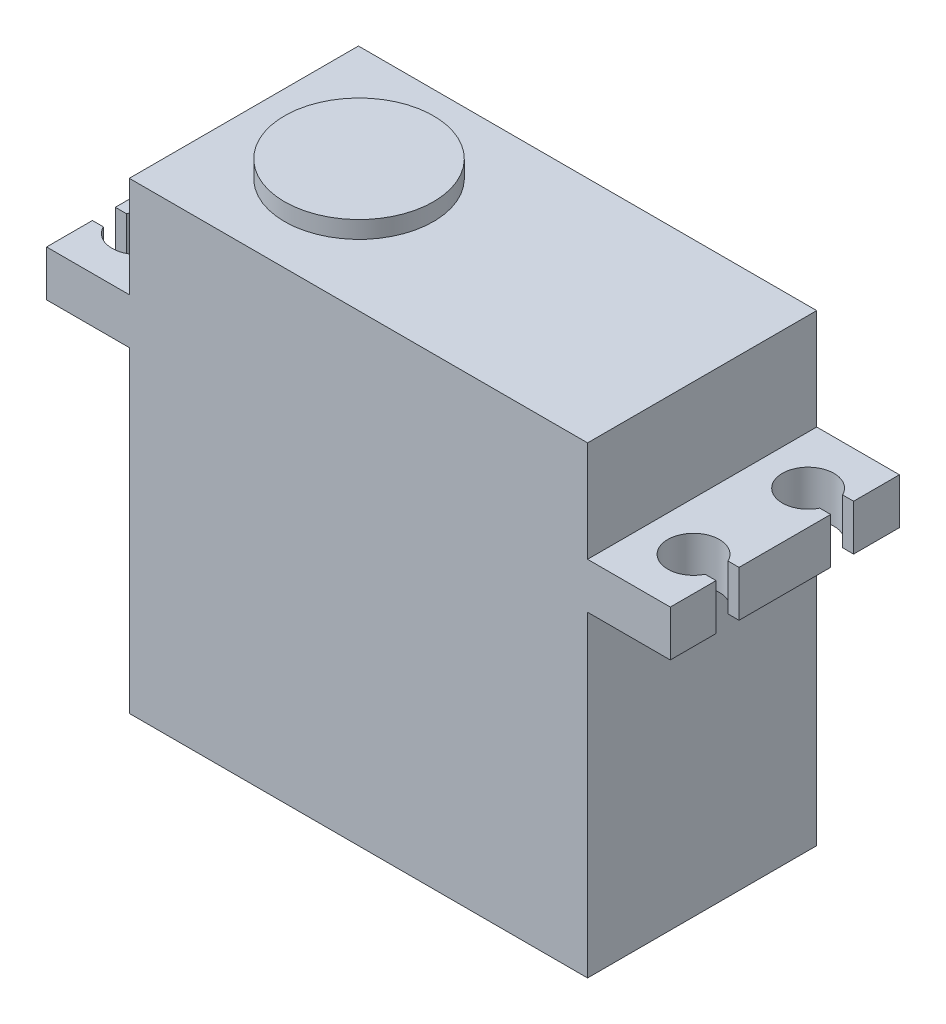
ISO-10303-21;
HEADER;
FILE_DESCRIPTION(('STEP AP214'),'2;1');
FILE_NAME('part.step','',(''),(''),'','','');
FILE_SCHEMA(('AUTOMOTIVE_DESIGN { 1 0 10303 214 1 1 1 1 }'));
ENDSEC;
DATA;
#1=APPLICATION_CONTEXT('core data for automotive mechanical design processes');
#2=APPLICATION_PROTOCOL_DEFINITION('international standard','automotive_design',2000,#1);
#3=PRODUCT_CONTEXT('',#1,'mechanical');
#4=PRODUCT('Part','Part','',(#3));
#5=PRODUCT_RELATED_PRODUCT_CATEGORY('part','',(#4));
#6=PRODUCT_DEFINITION_FORMATION('','',#4);
#7=PRODUCT_DEFINITION_CONTEXT('part definition',#1,'design');
#8=PRODUCT_DEFINITION('design','',#6,#7);
#9=PRODUCT_DEFINITION_SHAPE('','',#8);
#10=(LENGTH_UNIT() NAMED_UNIT(*) SI_UNIT(.MILLI.,.METRE.));
#11=(NAMED_UNIT(*) PLANE_ANGLE_UNIT() SI_UNIT($,.RADIAN.));
#12=(NAMED_UNIT(*) SI_UNIT($,.STERADIAN.) SOLID_ANGLE_UNIT());
#13=UNCERTAINTY_MEASURE_WITH_UNIT(LENGTH_MEASURE(1.E-05),#10,'distance_accuracy_value','');
#14=(GEOMETRIC_REPRESENTATION_CONTEXT(3) GLOBAL_UNCERTAINTY_ASSIGNED_CONTEXT((#13)) GLOBAL_UNIT_ASSIGNED_CONTEXT((#10,
#11,#12)) REPRESENTATION_CONTEXT('',''));
#15=CARTESIAN_POINT('',(0.,0.,0.));
#16=DIRECTION('',(0.,0.,1.));
#17=DIRECTION('',(1.,0.,0.));
#18=AXIS2_PLACEMENT_3D('',#15,#16,#17);
#19=CARTESIAN_POINT('',(27.22,0.,0.));
#20=DIRECTION('',(1.,0.,0.));
#21=DIRECTION('',(0.,0.,1.));
#22=AXIS2_PLACEMENT_3D('',#19,#20,#21);
#23=PLANE('',#22);
#24=DIRECTION('',(0.,1.,0.));
#25=VECTOR('',#24,1.);
#26=CARTESIAN_POINT('',(27.22,27.65,4.));
#27=LINE('',#26,#25);
#28=CARTESIAN_POINT('',(27.22,27.65,4.));
#29=VERTEX_POINT('',#28);
#30=CARTESIAN_POINT('',(27.22,31.65,4.));
#31=VERTEX_POINT('',#30);
#32=EDGE_CURVE('E285',#29,#31,#27,.T.);
#33=ORIENTED_EDGE('',*,*,#32,.F.);
#34=DIRECTION('',(0.,0.,1.));
#35=VECTOR('',#34,1.);
#36=CARTESIAN_POINT('',(27.22,27.65,-10.));
#37=LINE('',#36,#35);
#38=CARTESIAN_POINT('',(27.22,27.65,-4.));
#39=VERTEX_POINT('',#38);
#40=EDGE_CURVE('E328',#39,#29,#37,.T.);
#41=ORIENTED_EDGE('',*,*,#40,.F.);
#42=DIRECTION('',(0.,1.,0.));
#43=VECTOR('',#42,1.);
#44=CARTESIAN_POINT('',(27.22,27.65,-4.));
#45=LINE('',#44,#43);
#46=CARTESIAN_POINT('',(27.22,31.65,-4.));
#47=VERTEX_POINT('',#46);
#48=EDGE_CURVE('E308',#39,#47,#45,.T.);
#49=ORIENTED_EDGE('',*,*,#48,.T.);
#50=DIRECTION('',(0.,0.,-1.));
#51=VECTOR('',#50,1.);
#52=CARTESIAN_POINT('',(27.22,31.65,10.));
#53=LINE('',#52,#51);
#54=EDGE_CURVE('E63',#31,#47,#53,.T.);
#55=ORIENTED_EDGE('',*,*,#54,.F.);
#56=EDGE_LOOP('',(#33,#41,#49,#55));
#57=FACE_BOUND('',#56,.T.);
#58=ADVANCED_FACE('F40',(#57),#23,.T.);
#59=CARTESIAN_POINT('',(27.22,31.65,10.));
#60=DIRECTION('',(0.,1.,0.));
#61=DIRECTION('',(0.,0.,1.));
#62=AXIS2_PLACEMENT_3D('',#59,#60,#61);
#63=PLANE('',#62);
#64=DIRECTION('',(-1.,0.,0.));
#65=VECTOR('',#64,1.);
#66=CARTESIAN_POINT('',(27.22,31.65,4.));
#67=LINE('',#66,#65);
#68=CARTESIAN_POINT('',(26.2655644370746,31.65,4.));
#69=VERTEX_POINT('',#68);
#70=EDGE_CURVE('E270',#31,#69,#67,.T.);
#71=ORIENTED_EDGE('',*,*,#70,.F.);
#72=ORIENTED_EDGE('',*,*,#54,.T.);
#73=DIRECTION('',(-1.,0.,0.));
#74=VECTOR('',#73,1.);
#75=CARTESIAN_POINT('',(27.22,31.65,-4.));
#76=LINE('',#75,#74);
#77=CARTESIAN_POINT('',(26.2655644370746,31.65,-4.));
#78=VERTEX_POINT('',#77);
#79=EDGE_CURVE('E298',#47,#78,#76,.T.);
#80=ORIENTED_EDGE('',*,*,#79,.T.);
#81=CARTESIAN_POINT('',(24.25,31.65,-5.));
#82=DIRECTION('',(0.,-1.,0.));
#83=DIRECTION('',(0.,0.,1.));
#84=AXIS2_PLACEMENT_3D('',#81,#82,#83);
#85=CIRCLE('',#84,2.25);
#86=CARTESIAN_POINT('',(26.2655644370746,31.65,-6.));
#87=VERTEX_POINT('',#86);
#88=EDGE_CURVE('E284',#78,#87,#85,.T.);
#89=ORIENTED_EDGE('',*,*,#88,.T.);
#90=DIRECTION('',(1.,0.,0.));
#91=VECTOR('',#90,1.);
#92=CARTESIAN_POINT('',(26.2655644370746,31.65,-6.));
#93=LINE('',#92,#91);
#94=CARTESIAN_POINT('',(27.22,31.65,-6.));
#95=VERTEX_POINT('',#94);
#96=EDGE_CURVE('E291',#87,#95,#93,.T.);
#97=ORIENTED_EDGE('',*,*,#96,.T.);
#98=CARTESIAN_POINT('',(27.22,31.65,-10.));
#99=VERTEX_POINT('',#98);
#100=EDGE_CURVE('E315',#95,#99,#53,.T.);
#101=ORIENTED_EDGE('',*,*,#100,.T.);
#102=DIRECTION('',(-1.,0.,0.));
#103=VECTOR('',#102,1.);
#104=CARTESIAN_POINT('',(27.22,31.65,-10.));
#105=LINE('',#104,#103);
#106=CARTESIAN_POINT('',(20.,31.65,-10.));
#107=VERTEX_POINT('',#106);
#108=EDGE_CURVE('E338',#99,#107,#105,.T.);
#109=ORIENTED_EDGE('',*,*,#108,.T.);
#110=DIRECTION('',(0.,0.,-1.));
#111=VECTOR('',#110,1.);
#112=CARTESIAN_POINT('',(20.,31.65,10.));
#113=LINE('',#112,#111);
#114=CARTESIAN_POINT('',(20.,31.65,10.));
#115=VERTEX_POINT('',#114);
#116=EDGE_CURVE('E305',#115,#107,#113,.T.);
#117=ORIENTED_EDGE('',*,*,#116,.F.);
#118=DIRECTION('',(-1.,0.,0.));
#119=VECTOR('',#118,1.);
#120=CARTESIAN_POINT('',(27.22,31.65,10.));
#121=LINE('',#120,#119);
#122=CARTESIAN_POINT('',(27.22,31.65,10.));
#123=VERTEX_POINT('',#122);
#124=EDGE_CURVE('E336',#123,#115,#121,.T.);
#125=ORIENTED_EDGE('',*,*,#124,.F.);
#126=CARTESIAN_POINT('',(27.22,31.65,6.));
#127=VERTEX_POINT('',#126);
#128=EDGE_CURVE('E317',#123,#127,#53,.T.);
#129=ORIENTED_EDGE('',*,*,#128,.T.);
#130=DIRECTION('',(1.,0.,0.));
#131=VECTOR('',#130,1.);
#132=CARTESIAN_POINT('',(26.2655644370746,31.65,6.));
#133=LINE('',#132,#131);
#134=CARTESIAN_POINT('',(26.2655644370746,31.65,6.));
#135=VERTEX_POINT('',#134);
#136=EDGE_CURVE('E55',#135,#127,#133,.T.);
#137=ORIENTED_EDGE('',*,*,#136,.F.);
#138=CARTESIAN_POINT('',(24.25,31.65,5.));
#139=DIRECTION('',(0.,1.,0.));
#140=DIRECTION('',(0.,0.,-1.));
#141=AXIS2_PLACEMENT_3D('',#138,#139,#140);
#142=CIRCLE('',#141,2.25);
#143=EDGE_CURVE('E258',#69,#135,#142,.T.);
#144=ORIENTED_EDGE('',*,*,#143,.F.);
#145=EDGE_LOOP('',(#71,#72,#80,#89,#97,#101,#109,#117,#125,#129,#137,#144));
#146=FACE_BOUND('',#145,.T.);
#147=ADVANCED_FACE('F537',(#146),#63,.T.);
#148=CARTESIAN_POINT('',(27.22,27.65,-10.));
#149=DIRECTION('',(0.,-1.,0.));
#150=DIRECTION('',(0.,0.,-1.));
#151=AXIS2_PLACEMENT_3D('',#148,#149,#150);
#152=PLANE('',#151);
#153=DIRECTION('',(-1.,0.,0.));
#154=VECTOR('',#153,1.);
#155=CARTESIAN_POINT('',(27.22,27.65,4.));
#156=LINE('',#155,#154);
#157=CARTESIAN_POINT('',(26.2655644370746,27.65,4.));
#158=VERTEX_POINT('',#157);
#159=EDGE_CURVE('E260',#29,#158,#156,.T.);
#160=ORIENTED_EDGE('',*,*,#159,.T.);
#161=CARTESIAN_POINT('',(24.25,27.65,5.));
#162=DIRECTION('',(0.,1.,0.));
#163=DIRECTION('',(0.,0.,-1.));
#164=AXIS2_PLACEMENT_3D('',#161,#162,#163);
#165=CIRCLE('',#164,2.25);
#166=CARTESIAN_POINT('',(26.2655644370746,27.65,6.));
#167=VERTEX_POINT('',#166);
#168=EDGE_CURVE('E255',#158,#167,#165,.T.);
#169=ORIENTED_EDGE('',*,*,#168,.T.);
#170=DIRECTION('',(1.,0.,0.));
#171=VECTOR('',#170,1.);
#172=CARTESIAN_POINT('',(26.2655644370746,27.65,6.));
#173=LINE('',#172,#171);
#174=CARTESIAN_POINT('',(27.22,27.65,6.));
#175=VERTEX_POINT('',#174);
#176=EDGE_CURVE('E263',#167,#175,#173,.T.);
#177=ORIENTED_EDGE('',*,*,#176,.T.);
#178=CARTESIAN_POINT('',(27.22,27.65,10.));
#179=VERTEX_POINT('',#178);
#180=EDGE_CURVE('E323',#175,#179,#37,.T.);
#181=ORIENTED_EDGE('',*,*,#180,.T.);
#182=DIRECTION('',(-1.,0.,0.));
#183=VECTOR('',#182,1.);
#184=CARTESIAN_POINT('',(27.22,27.65,10.));
#185=LINE('',#184,#183);
#186=CARTESIAN_POINT('',(20.,27.65,10.));
#187=VERTEX_POINT('',#186);
#188=EDGE_CURVE('E334',#179,#187,#185,.T.);
#189=ORIENTED_EDGE('',*,*,#188,.T.);
#190=DIRECTION('',(0.,0.,1.));
#191=VECTOR('',#190,1.);
#192=CARTESIAN_POINT('',(20.,27.65,-10.));
#193=LINE('',#192,#191);
#194=CARTESIAN_POINT('',(20.,27.65,-10.));
#195=VERTEX_POINT('',#194);
#196=EDGE_CURVE('E316',#195,#187,#193,.T.);
#197=ORIENTED_EDGE('',*,*,#196,.F.);
#198=DIRECTION('',(-1.,0.,0.));
#199=VECTOR('',#198,1.);
#200=CARTESIAN_POINT('',(27.22,27.65,-10.));
#201=LINE('',#200,#199);
#202=CARTESIAN_POINT('',(27.22,27.65,-10.));
#203=VERTEX_POINT('',#202);
#204=EDGE_CURVE('E327',#203,#195,#201,.T.);
#205=ORIENTED_EDGE('',*,*,#204,.F.);
#206=CARTESIAN_POINT('',(27.22,27.65,-6.));
#207=VERTEX_POINT('',#206);
#208=EDGE_CURVE('E324',#203,#207,#37,.T.);
#209=ORIENTED_EDGE('',*,*,#208,.T.);
#210=DIRECTION('',(1.,0.,0.));
#211=VECTOR('',#210,1.);
#212=CARTESIAN_POINT('',(26.2655644370746,27.65,-6.));
#213=LINE('',#212,#211);
#214=CARTESIAN_POINT('',(26.2655644370746,27.65,-6.));
#215=VERTEX_POINT('',#214);
#216=EDGE_CURVE('E293',#215,#207,#213,.T.);
#217=ORIENTED_EDGE('',*,*,#216,.F.);
#218=CARTESIAN_POINT('',(24.25,27.65,-5.));
#219=DIRECTION('',(0.,-1.,0.));
#220=DIRECTION('',(0.,0.,1.));
#221=AXIS2_PLACEMENT_3D('',#218,#219,#220);
#222=CIRCLE('',#221,2.25);
#223=CARTESIAN_POINT('',(26.2655644370746,27.65,-4.));
#224=VERTEX_POINT('',#223);
#225=EDGE_CURVE('E288',#224,#215,#222,.T.);
#226=ORIENTED_EDGE('',*,*,#225,.F.);
#227=DIRECTION('',(-1.,0.,0.));
#228=VECTOR('',#227,1.);
#229=CARTESIAN_POINT('',(27.22,27.65,-4.));
#230=LINE('',#229,#228);
#231=EDGE_CURVE('E290',#39,#224,#230,.T.);
#232=ORIENTED_EDGE('',*,*,#231,.F.);
#233=ORIENTED_EDGE('',*,*,#40,.T.);
#234=EDGE_LOOP('',(#160,#169,#177,#181,#189,#197,#205,#209,#217,#226,#232,#233));
#235=FACE_BOUND('',#234,.T.);
#236=ADVANCED_FACE('F268',(#235),#152,.T.);
#237=ORIENTED_EDGE('',*,*,#100,.F.);
#238=DIRECTION('',(0.,1.,0.));
#239=VECTOR('',#238,1.);
#240=CARTESIAN_POINT('',(27.22,27.65,-6.));
#241=LINE('',#240,#239);
#242=EDGE_CURVE('E306',#207,#95,#241,.T.);
#243=ORIENTED_EDGE('',*,*,#242,.F.);
#244=ORIENTED_EDGE('',*,*,#208,.F.);
#245=DIRECTION('',(0.,-1.,0.));
#246=VECTOR('',#245,1.);
#247=CARTESIAN_POINT('',(27.22,31.65,-10.));
#248=LINE('',#247,#246);
#249=EDGE_CURVE('E312',#99,#203,#248,.T.);
#250=ORIENTED_EDGE('',*,*,#249,.F.);
#251=EDGE_LOOP('',(#237,#243,#244,#250));
#252=FACE_BOUND('',#251,.T.);
#253=ADVANCED_FACE('F542',(#252),#23,.T.);
#254=DIRECTION('',(0.,1.,0.));
#255=VECTOR('',#254,1.);
#256=CARTESIAN_POINT('',(27.22,27.65,6.));
#257=LINE('',#256,#255);
#258=EDGE_CURVE('E259',#175,#127,#257,.T.);
#259=ORIENTED_EDGE('',*,*,#258,.T.);
#260=ORIENTED_EDGE('',*,*,#128,.F.);
#261=DIRECTION('',(0.,1.,0.));
#262=VECTOR('',#261,1.);
#263=CARTESIAN_POINT('',(27.22,27.65,10.));
#264=LINE('',#263,#262);
#265=EDGE_CURVE('E320',#179,#123,#264,.T.);
#266=ORIENTED_EDGE('',*,*,#265,.F.);
#267=ORIENTED_EDGE('',*,*,#180,.F.);
#268=EDGE_LOOP('',(#259,#260,#266,#267));
#269=FACE_BOUND('',#268,.T.);
#270=ADVANCED_FACE('F549',(#269),#23,.T.);
#271=CARTESIAN_POINT('',(20.,27.65,10.));
#272=DIRECTION('',(-1.,0.,0.));
#273=DIRECTION('',(0.,0.,1.));
#274=AXIS2_PLACEMENT_3D('',#271,#272,#273);
#275=PLANE('',#274);
#276=DIRECTION('',(0.,-1.,0.));
#277=VECTOR('',#276,1.);
#278=CARTESIAN_POINT('',(20.,27.65,-10.));
#279=LINE('',#278,#277);
#280=CARTESIAN_POINT('',(20.,0.,-10.));
#281=VERTEX_POINT('',#280);
#282=EDGE_CURVE('E48',#195,#281,#279,.T.);
#283=ORIENTED_EDGE('',*,*,#282,.F.);
#284=ORIENTED_EDGE('',*,*,#196,.T.);
#285=DIRECTION('',(0.,-1.,0.));
#286=VECTOR('',#285,1.);
#287=CARTESIAN_POINT('',(20.,27.65,10.));
#288=LINE('',#287,#286);
#289=CARTESIAN_POINT('',(20.,0.,10.));
#290=VERTEX_POINT('',#289);
#291=EDGE_CURVE('E479',#187,#290,#288,.T.);
#292=ORIENTED_EDGE('',*,*,#291,.T.);
#293=DIRECTION('',(0.,0.,-1.));
#294=VECTOR('',#293,1.);
#295=CARTESIAN_POINT('',(20.,0.,10.));
#296=LINE('',#295,#294);
#297=EDGE_CURVE('E467',#290,#281,#296,.T.);
#298=ORIENTED_EDGE('',*,*,#297,.T.);
#299=EDGE_LOOP('',(#283,#284,#292,#298));
#300=FACE_BOUND('',#299,.T.);
#301=ADVANCED_FACE('F546',(#300),#275,.F.);
#302=CARTESIAN_POINT('',(-27.22,0.,0.));
#303=DIRECTION('',(-1.,0.,0.));
#304=DIRECTION('',(0.,0.,1.));
#305=AXIS2_PLACEMENT_3D('',#302,#303,#304);
#306=PLANE('',#305);
#307=DIRECTION('',(0.,0.,-1.));
#308=VECTOR('',#307,1.);
#309=CARTESIAN_POINT('',(-27.22,31.65,10.));
#310=LINE('',#309,#308);
#311=CARTESIAN_POINT('',(-27.22,31.65,10.));
#312=VERTEX_POINT('',#311);
#313=CARTESIAN_POINT('',(-27.22,31.65,6.));
#314=VERTEX_POINT('',#313);
#315=EDGE_CURVE('E406',#312,#314,#310,.T.);
#316=ORIENTED_EDGE('',*,*,#315,.T.);
#317=DIRECTION('',(0.,1.,0.));
#318=VECTOR('',#317,1.);
#319=CARTESIAN_POINT('',(-27.22,27.65,6.));
#320=LINE('',#319,#318);
#321=CARTESIAN_POINT('',(-27.22,27.65,6.));
#322=VERTEX_POINT('',#321);
#323=EDGE_CURVE('E360',#322,#314,#320,.T.);
#324=ORIENTED_EDGE('',*,*,#323,.F.);
#325=DIRECTION('',(0.,0.,1.));
#326=VECTOR('',#325,1.);
#327=CARTESIAN_POINT('',(-27.22,27.65,-10.));
#328=LINE('',#327,#326);
#329=CARTESIAN_POINT('',(-27.22,27.65,10.));
#330=VERTEX_POINT('',#329);
#331=EDGE_CURVE('E397',#322,#330,#328,.T.);
#332=ORIENTED_EDGE('',*,*,#331,.T.);
#333=DIRECTION('',(0.,1.,0.));
#334=VECTOR('',#333,1.);
#335=CARTESIAN_POINT('',(-27.22,27.65,10.));
#336=LINE('',#335,#334);
#337=EDGE_CURVE('E402',#330,#312,#336,.T.);
#338=ORIENTED_EDGE('',*,*,#337,.T.);
#339=EDGE_LOOP('',(#316,#324,#332,#338));
#340=FACE_BOUND('',#339,.T.);
#341=ADVANCED_FACE('F548',(#340),#306,.T.);
#342=CARTESIAN_POINT('',(-27.22,27.65,-4.));
#343=VERTEX_POINT('',#342);
#344=CARTESIAN_POINT('',(-27.22,27.65,4.));
#345=VERTEX_POINT('',#344);
#346=EDGE_CURVE('E403',#343,#345,#328,.T.);
#347=ORIENTED_EDGE('',*,*,#346,.T.);
#348=DIRECTION('',(0.,1.,0.));
#349=VECTOR('',#348,1.);
#350=CARTESIAN_POINT('',(-27.22,27.65,4.));
#351=LINE('',#350,#349);
#352=CARTESIAN_POINT('',(-27.22,31.65,4.));
#353=VERTEX_POINT('',#352);
#354=EDGE_CURVE('E362',#345,#353,#351,.T.);
#355=ORIENTED_EDGE('',*,*,#354,.T.);
#356=CARTESIAN_POINT('',(-27.22,31.65,-4.));
#357=VERTEX_POINT('',#356);
#358=EDGE_CURVE('E410',#353,#357,#310,.T.);
#359=ORIENTED_EDGE('',*,*,#358,.T.);
#360=DIRECTION('',(0.,1.,0.));
#361=VECTOR('',#360,1.);
#362=CARTESIAN_POINT('',(-27.22,27.65,-4.));
#363=LINE('',#362,#361);
#364=EDGE_CURVE('E387',#343,#357,#363,.T.);
#365=ORIENTED_EDGE('',*,*,#364,.F.);
#366=EDGE_LOOP('',(#347,#355,#359,#365));
#367=FACE_BOUND('',#366,.T.);
#368=ADVANCED_FACE('F554',(#367),#306,.T.);
#369=CARTESIAN_POINT('',(-27.22,27.65,-10.));
#370=DIRECTION('',(0.,1.,0.));
#371=DIRECTION('',(0.,0.,1.));
#372=AXIS2_PLACEMENT_3D('',#369,#370,#371);
#373=PLANE('',#372);
#374=DIRECTION('',(-1.,0.,0.));
#375=VECTOR('',#374,1.);
#376=CARTESIAN_POINT('',(-26.2655644370746,27.65,6.));
#377=LINE('',#376,#375);
#378=CARTESIAN_POINT('',(-26.2655644370746,27.65,6.));
#379=VERTEX_POINT('',#378);
#380=EDGE_CURVE('E346',#379,#322,#377,.T.);
#381=ORIENTED_EDGE('',*,*,#380,.F.);
#382=CARTESIAN_POINT('',(-24.25,27.65,5.));
#383=DIRECTION('',(0.,-1.,0.));
#384=DIRECTION('',(0.,0.,-1.));
#385=AXIS2_PLACEMENT_3D('',#382,#383,#384);
#386=CIRCLE('',#385,2.25);
#387=CARTESIAN_POINT('',(-26.2655644370746,27.65,4.));
#388=VERTEX_POINT('',#387);
#389=EDGE_CURVE('E341',#388,#379,#386,.T.);
#390=ORIENTED_EDGE('',*,*,#389,.F.);
#391=DIRECTION('',(1.,0.,0.));
#392=VECTOR('',#391,1.);
#393=CARTESIAN_POINT('',(-27.22,27.65,4.));
#394=LINE('',#393,#392);
#395=EDGE_CURVE('E343',#345,#388,#394,.T.);
#396=ORIENTED_EDGE('',*,*,#395,.F.);
#397=ORIENTED_EDGE('',*,*,#346,.F.);
#398=DIRECTION('',(1.,0.,0.));
#399=VECTOR('',#398,1.);
#400=CARTESIAN_POINT('',(-27.22,27.65,-4.));
#401=LINE('',#400,#399);
#402=CARTESIAN_POINT('',(-26.2655644370746,27.65,-4.));
#403=VERTEX_POINT('',#402);
#404=EDGE_CURVE('E374',#343,#403,#401,.T.);
#405=ORIENTED_EDGE('',*,*,#404,.T.);
#406=CARTESIAN_POINT('',(-24.25,27.65,-5.));
#407=DIRECTION('',(0.,1.,0.));
#408=DIRECTION('',(0.,0.,1.));
#409=AXIS2_PLACEMENT_3D('',#406,#407,#408);
#410=CIRCLE('',#409,2.25);
#411=CARTESIAN_POINT('',(-26.2655644370746,27.65,-6.));
#412=VERTEX_POINT('',#411);
#413=EDGE_CURVE('E367',#403,#412,#410,.T.);
#414=ORIENTED_EDGE('',*,*,#413,.T.);
#415=DIRECTION('',(-1.,0.,0.));
#416=VECTOR('',#415,1.);
#417=CARTESIAN_POINT('',(-26.2655644370746,27.65,-6.));
#418=LINE('',#417,#416);
#419=CARTESIAN_POINT('',(-27.22,27.65,-6.));
#420=VERTEX_POINT('',#419);
#421=EDGE_CURVE('E370',#412,#420,#418,.T.);
#422=ORIENTED_EDGE('',*,*,#421,.T.);
#423=CARTESIAN_POINT('',(-27.22,27.65,-10.));
#424=VERTEX_POINT('',#423);
#425=EDGE_CURVE('E399',#424,#420,#328,.T.);
#426=ORIENTED_EDGE('',*,*,#425,.F.);
#427=DIRECTION('',(1.,0.,0.));
#428=VECTOR('',#427,1.);
#429=CARTESIAN_POINT('',(-27.22,27.65,-10.));
#430=LINE('',#429,#428);
#431=CARTESIAN_POINT('',(-20.,27.65,-10.));
#432=VERTEX_POINT('',#431);
#433=EDGE_CURVE('E420',#424,#432,#430,.T.);
#434=ORIENTED_EDGE('',*,*,#433,.T.);
#435=DIRECTION('',(0.,0.,1.));
#436=VECTOR('',#435,1.);
#437=CARTESIAN_POINT('',(-20.,27.65,-10.));
#438=LINE('',#437,#436);
#439=CARTESIAN_POINT('',(-20.,27.65,10.));
#440=VERTEX_POINT('',#439);
#441=EDGE_CURVE('E386',#432,#440,#438,.T.);
#442=ORIENTED_EDGE('',*,*,#441,.T.);
#443=DIRECTION('',(1.,0.,0.));
#444=VECTOR('',#443,1.);
#445=CARTESIAN_POINT('',(-27.22,27.65,10.));
#446=LINE('',#445,#444);
#447=EDGE_CURVE('E418',#330,#440,#446,.T.);
#448=ORIENTED_EDGE('',*,*,#447,.F.);
#449=ORIENTED_EDGE('',*,*,#331,.F.);
#450=EDGE_LOOP('',(#381,#390,#396,#397,#405,#414,#422,#426,#434,#442,#448,#449));
#451=FACE_BOUND('',#450,.T.);
#452=ADVANCED_FACE('F517',(#451),#373,.F.);
#453=CARTESIAN_POINT('',(-27.22,31.65,10.));
#454=DIRECTION('',(0.,-1.,0.));
#455=DIRECTION('',(0.,0.,-1.));
#456=AXIS2_PLACEMENT_3D('',#453,#454,#455);
#457=PLANE('',#456);
#458=DIRECTION('',(-1.,0.,0.));
#459=VECTOR('',#458,1.);
#460=CARTESIAN_POINT('',(-26.2655644370746,31.65,6.));
#461=LINE('',#460,#459);
#462=CARTESIAN_POINT('',(-26.2655644370746,31.65,6.));
#463=VERTEX_POINT('',#462);
#464=EDGE_CURVE('E344',#463,#314,#461,.T.);
#465=ORIENTED_EDGE('',*,*,#464,.T.);
#466=ORIENTED_EDGE('',*,*,#315,.F.);
#467=DIRECTION('',(1.,0.,0.));
#468=VECTOR('',#467,1.);
#469=CARTESIAN_POINT('',(-27.22,31.65,10.));
#470=LINE('',#469,#468);
#471=CARTESIAN_POINT('',(-20.,31.65,10.));
#472=VERTEX_POINT('',#471);
#473=EDGE_CURVE('E416',#312,#472,#470,.T.);
#474=ORIENTED_EDGE('',*,*,#473,.T.);
#475=DIRECTION('',(0.,0.,-1.));
#476=VECTOR('',#475,1.);
#477=CARTESIAN_POINT('',(-20.,31.65,10.));
#478=LINE('',#477,#476);
#479=CARTESIAN_POINT('',(-20.,31.65,-10.));
#480=VERTEX_POINT('',#479);
#481=EDGE_CURVE('E398',#472,#480,#478,.T.);
#482=ORIENTED_EDGE('',*,*,#481,.T.);
#483=DIRECTION('',(1.,0.,0.));
#484=VECTOR('',#483,1.);
#485=CARTESIAN_POINT('',(-27.22,31.65,-10.));
#486=LINE('',#485,#484);
#487=CARTESIAN_POINT('',(-27.22,31.65,-10.));
#488=VERTEX_POINT('',#487);
#489=EDGE_CURVE('E409',#488,#480,#486,.T.);
#490=ORIENTED_EDGE('',*,*,#489,.F.);
#491=CARTESIAN_POINT('',(-27.22,31.65,-6.));
#492=VERTEX_POINT('',#491);
#493=EDGE_CURVE('E405',#492,#488,#310,.T.);
#494=ORIENTED_EDGE('',*,*,#493,.F.);
#495=DIRECTION('',(-1.,0.,0.));
#496=VECTOR('',#495,1.);
#497=CARTESIAN_POINT('',(-26.2655644370746,31.65,-6.));
#498=LINE('',#497,#496);
#499=CARTESIAN_POINT('',(-26.2655644370746,31.65,-6.));
#500=VERTEX_POINT('',#499);
#501=EDGE_CURVE('E380',#500,#492,#498,.T.);
#502=ORIENTED_EDGE('',*,*,#501,.F.);
#503=CARTESIAN_POINT('',(-24.25,31.65,-5.));
#504=DIRECTION('',(0.,1.,0.));
#505=DIRECTION('',(0.,0.,1.));
#506=AXIS2_PLACEMENT_3D('',#503,#504,#505);
#507=CIRCLE('',#506,2.25);
#508=CARTESIAN_POINT('',(-26.2655644370746,31.65,-4.));
#509=VERTEX_POINT('',#508);
#510=EDGE_CURVE('E359',#509,#500,#507,.T.);
#511=ORIENTED_EDGE('',*,*,#510,.F.);
#512=DIRECTION('',(1.,0.,0.));
#513=VECTOR('',#512,1.);
#514=CARTESIAN_POINT('',(-27.22,31.65,-4.));
#515=LINE('',#514,#513);
#516=EDGE_CURVE('E371',#357,#509,#515,.T.);
#517=ORIENTED_EDGE('',*,*,#516,.F.);
#518=ORIENTED_EDGE('',*,*,#358,.F.);
#519=DIRECTION('',(1.,0.,0.));
#520=VECTOR('',#519,1.);
#521=CARTESIAN_POINT('',(-27.22,31.65,4.));
#522=LINE('',#521,#520);
#523=CARTESIAN_POINT('',(-26.2655644370746,31.65,4.));
#524=VERTEX_POINT('',#523);
#525=EDGE_CURVE('E351',#353,#524,#522,.T.);
#526=ORIENTED_EDGE('',*,*,#525,.T.);
#527=CARTESIAN_POINT('',(-24.25,31.65,5.));
#528=DIRECTION('',(0.,-1.,0.));
#529=DIRECTION('',(0.,0.,-1.));
#530=AXIS2_PLACEMENT_3D('',#527,#528,#529);
#531=CIRCLE('',#530,2.25);
#532=EDGE_CURVE('E340',#524,#463,#531,.T.);
#533=ORIENTED_EDGE('',*,*,#532,.T.);
#534=EDGE_LOOP('',(#465,#466,#474,#482,#490,#494,#502,#511,#517,#518,#526,#533));
#535=FACE_BOUND('',#534,.T.);
#536=ADVANCED_FACE('F525',(#535),#457,.F.);
#537=CARTESIAN_POINT('',(-20.,27.65,10.));
#538=DIRECTION('',(1.,0.,0.));
#539=DIRECTION('',(0.,0.,-1.));
#540=AXIS2_PLACEMENT_3D('',#537,#538,#539);
#541=PLANE('',#540);
#542=DIRECTION('',(0.,1.,0.));
#543=VECTOR('',#542,1.);
#544=CARTESIAN_POINT('',(-20.,8.,3.5));
#545=LINE('',#544,#543);
#546=CARTESIAN_POINT('',(-20.,4.,3.5));
#547=VERTEX_POINT('',#546);
#548=CARTESIAN_POINT('',(-20.,8.,3.5));
#549=VERTEX_POINT('',#548);
#550=EDGE_CURVE('E434',#547,#549,#545,.T.);
#551=ORIENTED_EDGE('',*,*,#550,.F.);
#552=DIRECTION('',(0.,0.,1.));
#553=VECTOR('',#552,1.);
#554=CARTESIAN_POINT('',(-20.,4.,-3.5));
#555=LINE('',#554,#553);
#556=CARTESIAN_POINT('',(-20.,4.,-3.5));
#557=VERTEX_POINT('',#556);
#558=EDGE_CURVE('E439',#557,#547,#555,.T.);
#559=ORIENTED_EDGE('',*,*,#558,.F.);
#560=DIRECTION('',(0.,-1.,0.));
#561=VECTOR('',#560,1.);
#562=CARTESIAN_POINT('',(-20.,8.,-3.5));
#563=LINE('',#562,#561);
#564=CARTESIAN_POINT('',(-20.,8.,-3.5));
#565=VERTEX_POINT('',#564);
#566=EDGE_CURVE('E451',#565,#557,#563,.T.);
#567=ORIENTED_EDGE('',*,*,#566,.F.);
#568=DIRECTION('',(0.,0.,-1.));
#569=VECTOR('',#568,1.);
#570=CARTESIAN_POINT('',(-20.,8.,-3.5));
#571=LINE('',#570,#569);
#572=EDGE_CURVE('E448',#549,#565,#571,.T.);
#573=ORIENTED_EDGE('',*,*,#572,.F.);
#574=EDGE_LOOP('',(#551,#559,#567,#573));
#575=FACE_BOUND('',#574,.T.);
#576=ORIENTED_EDGE('',*,*,#441,.F.);
#577=DIRECTION('',(0.,-1.,0.));
#578=VECTOR('',#577,1.);
#579=CARTESIAN_POINT('',(-20.,27.65,-10.));
#580=LINE('',#579,#578);
#581=CARTESIAN_POINT('',(-20.,0.,-10.));
#582=VERTEX_POINT('',#581);
#583=EDGE_CURVE('E486',#432,#582,#580,.T.);
#584=ORIENTED_EDGE('',*,*,#583,.T.);
#585=DIRECTION('',(0.,0.,1.));
#586=VECTOR('',#585,1.);
#587=CARTESIAN_POINT('',(-20.,0.,10.));
#588=LINE('',#587,#586);
#589=CARTESIAN_POINT('',(-20.,0.,10.));
#590=VERTEX_POINT('',#589);
#591=EDGE_CURVE('E473',#582,#590,#588,.T.);
#592=ORIENTED_EDGE('',*,*,#591,.T.);
#593=DIRECTION('',(0.,-1.,0.));
#594=VECTOR('',#593,1.);
#595=CARTESIAN_POINT('',(-20.,27.65,10.));
#596=LINE('',#595,#594);
#597=EDGE_CURVE('E483',#440,#590,#596,.T.);
#598=ORIENTED_EDGE('',*,*,#597,.F.);
#599=EDGE_LOOP('',(#576,#584,#592,#598));
#600=FACE_BOUND('',#599,.T.);
#601=ADVANCED_FACE('F495',(#575,#600),#541,.F.);
#602=ORIENTED_EDGE('',*,*,#481,.F.);
#603=CARTESIAN_POINT('',(-20.,40.45,10.));
#604=VERTEX_POINT('',#603);
#605=EDGE_CURVE('E484',#604,#472,#596,.T.);
#606=ORIENTED_EDGE('',*,*,#605,.F.);
#607=DIRECTION('',(0.,0.,1.));
#608=VECTOR('',#607,1.);
#609=CARTESIAN_POINT('',(-20.,40.45,-10.));
#610=LINE('',#609,#608);
#611=CARTESIAN_POINT('',(-20.,40.45,-10.));
#612=VERTEX_POINT('',#611);
#613=EDGE_CURVE('E431',#612,#604,#610,.T.);
#614=ORIENTED_EDGE('',*,*,#613,.F.);
#615=EDGE_CURVE('E487',#612,#480,#580,.T.);
#616=ORIENTED_EDGE('',*,*,#615,.T.);
#617=EDGE_LOOP('',(#602,#606,#614,#616));
#618=FACE_BOUND('',#617,.T.);
#619=ADVANCED_FACE('F527',(#618),#541,.F.);
#620=CARTESIAN_POINT('',(20.,40.45,10.));
#621=VERTEX_POINT('',#620);
#622=EDGE_CURVE('E480',#621,#115,#288,.T.);
#623=ORIENTED_EDGE('',*,*,#622,.T.);
#624=ORIENTED_EDGE('',*,*,#116,.T.);
#625=CARTESIAN_POINT('',(20.,40.45,-10.));
#626=VERTEX_POINT('',#625);
#627=EDGE_CURVE('E12',#626,#107,#279,.T.);
#628=ORIENTED_EDGE('',*,*,#627,.F.);
#629=DIRECTION('',(0.,0.,-1.));
#630=VECTOR('',#629,1.);
#631=CARTESIAN_POINT('',(20.,40.45,10.));
#632=LINE('',#631,#630);
#633=EDGE_CURVE('E425',#621,#626,#632,.T.);
#634=ORIENTED_EDGE('',*,*,#633,.F.);
#635=EDGE_LOOP('',(#623,#624,#628,#634));
#636=FACE_BOUND('',#635,.T.);
#637=ADVANCED_FACE('F42',(#636),#275,.F.);
#638=CARTESIAN_POINT('',(-20.,27.65,-10.));
#639=DIRECTION('',(0.,0.,1.));
#640=DIRECTION('',(1.,0.,0.));
#641=AXIS2_PLACEMENT_3D('',#638,#639,#640);
#642=PLANE('',#641);
#643=DIRECTION('',(-1.,0.,0.));
#644=VECTOR('',#643,1.);
#645=CARTESIAN_POINT('',(-20.,0.,-10.));
#646=LINE('',#645,#644);
#647=EDGE_CURVE('E470',#281,#582,#646,.T.);
#648=ORIENTED_EDGE('',*,*,#647,.T.);
#649=ORIENTED_EDGE('',*,*,#583,.F.);
#650=ORIENTED_EDGE('',*,*,#433,.F.);
#651=DIRECTION('',(0.,-1.,0.));
#652=VECTOR('',#651,1.);
#653=CARTESIAN_POINT('',(-27.22,31.65,-10.));
#654=LINE('',#653,#652);
#655=EDGE_CURVE('E394',#488,#424,#654,.T.);
#656=ORIENTED_EDGE('',*,*,#655,.F.);
#657=ORIENTED_EDGE('',*,*,#489,.T.);
#658=ORIENTED_EDGE('',*,*,#615,.F.);
#659=DIRECTION('',(-1.,0.,0.));
#660=VECTOR('',#659,1.);
#661=CARTESIAN_POINT('',(20.,40.45,-10.));
#662=LINE('',#661,#660);
#663=EDGE_CURVE('E428',#626,#612,#662,.T.);
#664=ORIENTED_EDGE('',*,*,#663,.F.);
#665=ORIENTED_EDGE('',*,*,#627,.T.);
#666=ORIENTED_EDGE('',*,*,#108,.F.);
#667=ORIENTED_EDGE('',*,*,#249,.T.);
#668=ORIENTED_EDGE('',*,*,#204,.T.);
#669=ORIENTED_EDGE('',*,*,#282,.T.);
#670=EDGE_LOOP('',(#648,#649,#650,#656,#657,#658,#664,#665,#666,#667,#668,#669));
#671=FACE_BOUND('',#670,.T.);
#672=ADVANCED_FACE('F502',(#671),#642,.F.);
#673=CARTESIAN_POINT('',(-20.,27.65,10.));
#674=DIRECTION('',(0.,0.,-1.));
#675=DIRECTION('',(-1.,0.,0.));
#676=AXIS2_PLACEMENT_3D('',#673,#674,#675);
#677=PLANE('',#676);
#678=DIRECTION('',(1.,0.,0.));
#679=VECTOR('',#678,1.);
#680=CARTESIAN_POINT('',(-20.,0.,10.));
#681=LINE('',#680,#679);
#682=EDGE_CURVE('E476',#590,#290,#681,.T.);
#683=ORIENTED_EDGE('',*,*,#682,.T.);
#684=ORIENTED_EDGE('',*,*,#291,.F.);
#685=ORIENTED_EDGE('',*,*,#188,.F.);
#686=ORIENTED_EDGE('',*,*,#265,.T.);
#687=ORIENTED_EDGE('',*,*,#124,.T.);
#688=ORIENTED_EDGE('',*,*,#622,.F.);
#689=DIRECTION('',(1.,0.,0.));
#690=VECTOR('',#689,1.);
#691=CARTESIAN_POINT('',(-20.,40.45,10.));
#692=LINE('',#691,#690);
#693=EDGE_CURVE('E422',#604,#621,#692,.T.);
#694=ORIENTED_EDGE('',*,*,#693,.F.);
#695=ORIENTED_EDGE('',*,*,#605,.T.);
#696=ORIENTED_EDGE('',*,*,#473,.F.);
#697=ORIENTED_EDGE('',*,*,#337,.F.);
#698=ORIENTED_EDGE('',*,*,#447,.T.);
#699=ORIENTED_EDGE('',*,*,#597,.T.);
#700=EDGE_LOOP('',(#683,#684,#685,#686,#687,#688,#694,#695,#696,#697,#698,#699));
#701=FACE_BOUND('',#700,.T.);
#702=ADVANCED_FACE('F509',(#701),#677,.F.);
#703=CARTESIAN_POINT('',(0.,0.,0.));
#704=DIRECTION('',(0.,-1.,0.));
#705=DIRECTION('',(0.,0.,-1.));
#706=AXIS2_PLACEMENT_3D('',#703,#704,#705);
#707=PLANE('',#706);
#708=ORIENTED_EDGE('',*,*,#297,.F.);
#709=ORIENTED_EDGE('',*,*,#682,.F.);
#710=ORIENTED_EDGE('',*,*,#591,.F.);
#711=ORIENTED_EDGE('',*,*,#647,.F.);
#712=EDGE_LOOP('',(#708,#709,#710,#711));
#713=FACE_BOUND('',#712,.T.);
#714=ADVANCED_FACE('F506',(#713),#707,.T.);
#715=CARTESIAN_POINT('',(-25.,8.,3.5));
#716=DIRECTION('',(0.,0.,-1.));
#717=DIRECTION('',(0.,1.,0.));
#718=AXIS2_PLACEMENT_3D('',#715,#716,#717);
#719=PLANE('',#718);
#720=ORIENTED_EDGE('',*,*,#550,.T.);
#721=DIRECTION('',(1.,0.,0.));
#722=VECTOR('',#721,1.);
#723=CARTESIAN_POINT('',(-25.,8.,3.5));
#724=LINE('',#723,#722);
#725=CARTESIAN_POINT('',(-25.,8.,3.5));
#726=VERTEX_POINT('',#725);
#727=EDGE_CURVE('E464',#726,#549,#724,.T.);
#728=ORIENTED_EDGE('',*,*,#727,.F.);
#729=DIRECTION('',(0.,1.,0.));
#730=VECTOR('',#729,1.);
#731=CARTESIAN_POINT('',(-25.,8.,3.5));
#732=LINE('',#731,#730);
#733=CARTESIAN_POINT('',(-25.,4.,3.5));
#734=VERTEX_POINT('',#733);
#735=EDGE_CURVE('E435',#734,#726,#732,.T.);
#736=ORIENTED_EDGE('',*,*,#735,.F.);
#737=DIRECTION('',(1.,0.,0.));
#738=VECTOR('',#737,1.);
#739=CARTESIAN_POINT('',(-25.,4.,3.5));
#740=LINE('',#739,#738);
#741=EDGE_CURVE('E445',#734,#547,#740,.T.);
#742=ORIENTED_EDGE('',*,*,#741,.T.);
#743=EDGE_LOOP('',(#720,#728,#736,#742));
#744=FACE_BOUND('',#743,.T.);
#745=ADVANCED_FACE('F624',(#744),#719,.F.);
#746=CARTESIAN_POINT('',(-25.,8.,-3.5));
#747=DIRECTION('',(0.,-1.,0.));
#748=DIRECTION('',(0.,0.,-1.));
#749=AXIS2_PLACEMENT_3D('',#746,#747,#748);
#750=PLANE('',#749);
#751=ORIENTED_EDGE('',*,*,#572,.T.);
#752=DIRECTION('',(1.,0.,0.));
#753=VECTOR('',#752,1.);
#754=CARTESIAN_POINT('',(-25.,8.,-3.5));
#755=LINE('',#754,#753);
#756=CARTESIAN_POINT('',(-25.,8.,-3.5));
#757=VERTEX_POINT('',#756);
#758=EDGE_CURVE('E461',#757,#565,#755,.T.);
#759=ORIENTED_EDGE('',*,*,#758,.F.);
#760=DIRECTION('',(0.,0.,-1.));
#761=VECTOR('',#760,1.);
#762=CARTESIAN_POINT('',(-25.,8.,-3.5));
#763=LINE('',#762,#761);
#764=EDGE_CURVE('E438',#726,#757,#763,.T.);
#765=ORIENTED_EDGE('',*,*,#764,.F.);
#766=ORIENTED_EDGE('',*,*,#727,.T.);
#767=EDGE_LOOP('',(#751,#759,#765,#766));
#768=FACE_BOUND('',#767,.T.);
#769=ADVANCED_FACE('F620',(#768),#750,.F.);
#770=CARTESIAN_POINT('',(-25.,8.,-3.5));
#771=DIRECTION('',(0.,0.,1.));
#772=DIRECTION('',(0.,-1.,0.));
#773=AXIS2_PLACEMENT_3D('',#770,#771,#772);
#774=PLANE('',#773);
#775=ORIENTED_EDGE('',*,*,#566,.T.);
#776=DIRECTION('',(1.,0.,0.));
#777=VECTOR('',#776,1.);
#778=CARTESIAN_POINT('',(-25.,4.,-3.5));
#779=LINE('',#778,#777);
#780=CARTESIAN_POINT('',(-25.,4.,-3.5));
#781=VERTEX_POINT('',#780);
#782=EDGE_CURVE('E458',#781,#557,#779,.T.);
#783=ORIENTED_EDGE('',*,*,#782,.F.);
#784=DIRECTION('',(0.,-1.,0.));
#785=VECTOR('',#784,1.);
#786=CARTESIAN_POINT('',(-25.,8.,-3.5));
#787=LINE('',#786,#785);
#788=EDGE_CURVE('E441',#757,#781,#787,.T.);
#789=ORIENTED_EDGE('',*,*,#788,.F.);
#790=ORIENTED_EDGE('',*,*,#758,.T.);
#791=EDGE_LOOP('',(#775,#783,#789,#790));
#792=FACE_BOUND('',#791,.T.);
#793=ADVANCED_FACE('F616',(#792),#774,.F.);
#794=CARTESIAN_POINT('',(-25.,4.,-3.5));
#795=DIRECTION('',(0.,1.,0.));
#796=DIRECTION('',(0.,0.,1.));
#797=AXIS2_PLACEMENT_3D('',#794,#795,#796);
#798=PLANE('',#797);
#799=ORIENTED_EDGE('',*,*,#558,.T.);
#800=ORIENTED_EDGE('',*,*,#741,.F.);
#801=DIRECTION('',(0.,0.,1.));
#802=VECTOR('',#801,1.);
#803=CARTESIAN_POINT('',(-25.,4.,-3.5));
#804=LINE('',#803,#802);
#805=EDGE_CURVE('E443',#781,#734,#804,.T.);
#806=ORIENTED_EDGE('',*,*,#805,.F.);
#807=ORIENTED_EDGE('',*,*,#782,.T.);
#808=EDGE_LOOP('',(#799,#800,#806,#807));
#809=FACE_BOUND('',#808,.T.);
#810=ADVANCED_FACE('F612',(#809),#798,.F.);
#811=CARTESIAN_POINT('',(-25.,0.,0.));
#812=DIRECTION('',(-1.,0.,0.));
#813=DIRECTION('',(0.,0.,1.));
#814=AXIS2_PLACEMENT_3D('',#811,#812,#813);
#815=PLANE('',#814);
#816=ORIENTED_EDGE('',*,*,#735,.T.);
#817=ORIENTED_EDGE('',*,*,#764,.T.);
#818=ORIENTED_EDGE('',*,*,#788,.T.);
#819=ORIENTED_EDGE('',*,*,#805,.T.);
#820=EDGE_LOOP('',(#816,#817,#818,#819));
#821=FACE_BOUND('',#820,.T.);
#822=ADVANCED_FACE('F608',(#821),#815,.T.);
#823=CARTESIAN_POINT('',(0.,40.45,0.));
#824=DIRECTION('',(0.,1.,0.));
#825=DIRECTION('',(0.,0.,1.));
#826=AXIS2_PLACEMENT_3D('',#823,#824,#825);
#827=PLANE('',#826);
#828=CARTESIAN_POINT('',(-9.95,40.45,0.));
#829=DIRECTION('',(0.,1.,0.));
#830=DIRECTION('',(0.,0.,1.));
#831=AXIS2_PLACEMENT_3D('',#828,#829,#830);
#832=CIRCLE('',#831,6.5);
#833=CARTESIAN_POINT('',(-9.95,40.45,6.50000000000001));
#834=VERTEX_POINT('',#833);
#835=EDGE_CURVE('E275',#834,#834,#832,.T.);
#836=ORIENTED_EDGE('',*,*,#835,.F.);
#837=EDGE_LOOP('',(#836));
#838=FACE_BOUND('',#837,.T.);
#839=ORIENTED_EDGE('',*,*,#693,.T.);
#840=ORIENTED_EDGE('',*,*,#633,.T.);
#841=ORIENTED_EDGE('',*,*,#663,.T.);
#842=ORIENTED_EDGE('',*,*,#613,.T.);
#843=EDGE_LOOP('',(#839,#840,#841,#842));
#844=FACE_BOUND('',#843,.T.);
#845=ADVANCED_FACE('F531',(#838,#844),#827,.T.);
#846=DIRECTION('',(0.,1.,0.));
#847=VECTOR('',#846,1.);
#848=CARTESIAN_POINT('',(-27.22,27.65,-6.));
#849=LINE('',#848,#847);
#850=EDGE_CURVE('E390',#420,#492,#849,.T.);
#851=ORIENTED_EDGE('',*,*,#850,.T.);
#852=ORIENTED_EDGE('',*,*,#493,.T.);
#853=ORIENTED_EDGE('',*,*,#655,.T.);
#854=ORIENTED_EDGE('',*,*,#425,.T.);
#855=EDGE_LOOP('',(#851,#852,#853,#854));
#856=FACE_BOUND('',#855,.T.);
#857=ADVANCED_FACE('F521',(#856),#306,.T.);
#858=CARTESIAN_POINT('',(-24.25,27.65,-5.));
#859=DIRECTION('',(0.,1.,0.));
#860=DIRECTION('',(0.,0.,1.));
#861=AXIS2_PLACEMENT_3D('',#858,#859,#860);
#862=CYLINDRICAL_SURFACE('',#861,2.25);
#863=ORIENTED_EDGE('',*,*,#510,.T.);
#864=DIRECTION('',(0.,1.,0.));
#865=VECTOR('',#864,1.);
#866=CARTESIAN_POINT('',(-26.2655644370746,27.65,-6.));
#867=LINE('',#866,#865);
#868=EDGE_CURVE('E377',#412,#500,#867,.T.);
#869=ORIENTED_EDGE('',*,*,#868,.F.);
#870=ORIENTED_EDGE('',*,*,#413,.F.);
#871=DIRECTION('',(0.,1.,0.));
#872=VECTOR('',#871,1.);
#873=CARTESIAN_POINT('',(-26.2655644370746,27.65,-4.));
#874=LINE('',#873,#872);
#875=EDGE_CURVE('E384',#403,#509,#874,.T.);
#876=ORIENTED_EDGE('',*,*,#875,.T.);
#877=EDGE_LOOP('',(#863,#869,#870,#876));
#878=FACE_BOUND('',#877,.T.);
#879=ADVANCED_FACE('F593',(#878),#862,.F.);
#880=CARTESIAN_POINT('',(-27.22,27.65,-4.));
#881=DIRECTION('',(0.,0.,1.));
#882=DIRECTION('',(1.,0.,0.));
#883=AXIS2_PLACEMENT_3D('',#880,#881,#882);
#884=PLANE('',#883);
#885=ORIENTED_EDGE('',*,*,#516,.T.);
#886=ORIENTED_EDGE('',*,*,#875,.F.);
#887=ORIENTED_EDGE('',*,*,#404,.F.);
#888=ORIENTED_EDGE('',*,*,#364,.T.);
#889=EDGE_LOOP('',(#885,#886,#887,#888));
#890=FACE_BOUND('',#889,.T.);
#891=ADVANCED_FACE('F590',(#890),#884,.F.);
#892=CARTESIAN_POINT('',(-26.2655644370746,27.65,-6.));
#893=DIRECTION('',(0.,0.,-1.));
#894=DIRECTION('',(-1.,0.,0.));
#895=AXIS2_PLACEMENT_3D('',#892,#893,#894);
#896=PLANE('',#895);
#897=ORIENTED_EDGE('',*,*,#501,.T.);
#898=ORIENTED_EDGE('',*,*,#850,.F.);
#899=ORIENTED_EDGE('',*,*,#421,.F.);
#900=ORIENTED_EDGE('',*,*,#868,.T.);
#901=EDGE_LOOP('',(#897,#898,#899,#900));
#902=FACE_BOUND('',#901,.T.);
#903=ADVANCED_FACE('F588',(#902),#896,.F.);
#904=CARTESIAN_POINT('',(-24.25,27.65,5.));
#905=DIRECTION('',(0.,1.,0.));
#906=DIRECTION('',(0.,0.,1.));
#907=AXIS2_PLACEMENT_3D('',#904,#905,#906);
#908=CYLINDRICAL_SURFACE('',#907,2.25);
#909=ORIENTED_EDGE('',*,*,#532,.F.);
#910=DIRECTION('',(0.,1.,0.));
#911=VECTOR('',#910,1.);
#912=CARTESIAN_POINT('',(-26.2655644370746,27.65,4.));
#913=LINE('',#912,#911);
#914=EDGE_CURVE('E348',#388,#524,#913,.T.);
#915=ORIENTED_EDGE('',*,*,#914,.F.);
#916=ORIENTED_EDGE('',*,*,#389,.T.);
#917=DIRECTION('',(0.,1.,0.));
#918=VECTOR('',#917,1.);
#919=CARTESIAN_POINT('',(-26.2655644370746,27.65,6.));
#920=LINE('',#919,#918);
#921=EDGE_CURVE('E356',#379,#463,#920,.T.);
#922=ORIENTED_EDGE('',*,*,#921,.T.);
#923=EDGE_LOOP('',(#909,#915,#916,#922));
#924=FACE_BOUND('',#923,.T.);
#925=ADVANCED_FACE('F580',(#924),#908,.F.);
#926=CARTESIAN_POINT('',(-26.2655644370746,27.65,6.));
#927=DIRECTION('',(0.,0.,-1.));
#928=DIRECTION('',(-1.,0.,0.));
#929=AXIS2_PLACEMENT_3D('',#926,#927,#928);
#930=PLANE('',#929);
#931=ORIENTED_EDGE('',*,*,#464,.F.);
#932=ORIENTED_EDGE('',*,*,#921,.F.);
#933=ORIENTED_EDGE('',*,*,#380,.T.);
#934=ORIENTED_EDGE('',*,*,#323,.T.);
#935=EDGE_LOOP('',(#931,#932,#933,#934));
#936=FACE_BOUND('',#935,.T.);
#937=ADVANCED_FACE('F576',(#936),#930,.T.);
#938=CARTESIAN_POINT('',(-27.22,27.65,4.));
#939=DIRECTION('',(0.,0.,1.));
#940=DIRECTION('',(1.,0.,0.));
#941=AXIS2_PLACEMENT_3D('',#938,#939,#940);
#942=PLANE('',#941);
#943=ORIENTED_EDGE('',*,*,#525,.F.);
#944=ORIENTED_EDGE('',*,*,#354,.F.);
#945=ORIENTED_EDGE('',*,*,#395,.T.);
#946=ORIENTED_EDGE('',*,*,#914,.T.);
#947=EDGE_LOOP('',(#943,#944,#945,#946));
#948=FACE_BOUND('',#947,.T.);
#949=ADVANCED_FACE('F579',(#948),#942,.T.);
#950=CARTESIAN_POINT('',(24.25,27.65,-5.));
#951=DIRECTION('',(0.,1.,0.));
#952=DIRECTION('',(0.,0.,1.));
#953=AXIS2_PLACEMENT_3D('',#950,#951,#952);
#954=CYLINDRICAL_SURFACE('',#953,2.25);
#955=ORIENTED_EDGE('',*,*,#88,.F.);
#956=DIRECTION('',(0.,1.,0.));
#957=VECTOR('',#956,1.);
#958=CARTESIAN_POINT('',(26.2655644370746,27.65,-4.));
#959=LINE('',#958,#957);
#960=EDGE_CURVE('E295',#224,#78,#959,.T.);
#961=ORIENTED_EDGE('',*,*,#960,.F.);
#962=ORIENTED_EDGE('',*,*,#225,.T.);
#963=DIRECTION('',(0.,1.,0.));
#964=VECTOR('',#963,1.);
#965=CARTESIAN_POINT('',(26.2655644370746,27.65,-6.));
#966=LINE('',#965,#964);
#967=EDGE_CURVE('E302',#215,#87,#966,.T.);
#968=ORIENTED_EDGE('',*,*,#967,.T.);
#969=EDGE_LOOP('',(#955,#961,#962,#968));
#970=FACE_BOUND('',#969,.T.);
#971=ADVANCED_FACE('F584',(#970),#954,.F.);
#972=CARTESIAN_POINT('',(26.2655644370746,27.65,-6.));
#973=DIRECTION('',(0.,0.,1.));
#974=DIRECTION('',(1.,0.,0.));
#975=AXIS2_PLACEMENT_3D('',#972,#973,#974);
#976=PLANE('',#975);
#977=ORIENTED_EDGE('',*,*,#96,.F.);
#978=ORIENTED_EDGE('',*,*,#967,.F.);
#979=ORIENTED_EDGE('',*,*,#216,.T.);
#980=ORIENTED_EDGE('',*,*,#242,.T.);
#981=EDGE_LOOP('',(#977,#978,#979,#980));
#982=FACE_BOUND('',#981,.T.);
#983=ADVANCED_FACE('F713',(#982),#976,.T.);
#984=CARTESIAN_POINT('',(27.22,27.65,-4.));
#985=DIRECTION('',(0.,0.,-1.));
#986=DIRECTION('',(-1.,0.,0.));
#987=AXIS2_PLACEMENT_3D('',#984,#985,#986);
#988=PLANE('',#987);
#989=ORIENTED_EDGE('',*,*,#79,.F.);
#990=ORIENTED_EDGE('',*,*,#48,.F.);
#991=ORIENTED_EDGE('',*,*,#231,.T.);
#992=ORIENTED_EDGE('',*,*,#960,.T.);
#993=EDGE_LOOP('',(#989,#990,#991,#992));
#994=FACE_BOUND('',#993,.T.);
#995=ADVANCED_FACE('F720',(#994),#988,.T.);
#996=CARTESIAN_POINT('',(24.25,27.65,5.));
#997=DIRECTION('',(0.,1.,0.));
#998=DIRECTION('',(0.,0.,1.));
#999=AXIS2_PLACEMENT_3D('',#996,#997,#998);
#1000=CYLINDRICAL_SURFACE('',#999,2.25);
#1001=ORIENTED_EDGE('',*,*,#143,.T.);
#1002=DIRECTION('',(0.,1.,0.));
#1003=VECTOR('',#1002,1.);
#1004=CARTESIAN_POINT('',(26.2655644370746,27.65,6.));
#1005=LINE('',#1004,#1003);
#1006=EDGE_CURVE('E251',#167,#135,#1005,.T.);
#1007=ORIENTED_EDGE('',*,*,#1006,.F.);
#1008=ORIENTED_EDGE('',*,*,#168,.F.);
#1009=DIRECTION('',(0.,1.,0.));
#1010=VECTOR('',#1009,1.);
#1011=CARTESIAN_POINT('',(26.2655644370746,27.65,4.));
#1012=LINE('',#1011,#1010);
#1013=EDGE_CURVE('E282',#158,#69,#1012,.T.);
#1014=ORIENTED_EDGE('',*,*,#1013,.T.);
#1015=EDGE_LOOP('',(#1001,#1007,#1008,#1014));
#1016=FACE_BOUND('',#1015,.T.);
#1017=ADVANCED_FACE('F253',(#1016),#1000,.F.);
#1018=CARTESIAN_POINT('',(27.22,27.65,4.));
#1019=DIRECTION('',(0.,0.,-1.));
#1020=DIRECTION('',(-1.,0.,0.));
#1021=AXIS2_PLACEMENT_3D('',#1018,#1019,#1020);
#1022=PLANE('',#1021);
#1023=ORIENTED_EDGE('',*,*,#70,.T.);
#1024=ORIENTED_EDGE('',*,*,#1013,.F.);
#1025=ORIENTED_EDGE('',*,*,#159,.F.);
#1026=ORIENTED_EDGE('',*,*,#32,.T.);
#1027=EDGE_LOOP('',(#1023,#1024,#1025,#1026));
#1028=FACE_BOUND('',#1027,.T.);
#1029=ADVANCED_FACE('F735',(#1028),#1022,.F.);
#1030=CARTESIAN_POINT('',(26.2655644370746,27.65,6.));
#1031=DIRECTION('',(0.,0.,1.));
#1032=DIRECTION('',(1.,0.,0.));
#1033=AXIS2_PLACEMENT_3D('',#1030,#1031,#1032);
#1034=PLANE('',#1033);
#1035=ORIENTED_EDGE('',*,*,#136,.T.);
#1036=ORIENTED_EDGE('',*,*,#258,.F.);
#1037=ORIENTED_EDGE('',*,*,#176,.F.);
#1038=ORIENTED_EDGE('',*,*,#1006,.T.);
#1039=EDGE_LOOP('',(#1035,#1036,#1037,#1038));
#1040=FACE_BOUND('',#1039,.T.);
#1041=ADVANCED_FACE('F264',(#1040),#1034,.F.);
#1042=CARTESIAN_POINT('',(-9.95,41.95,0.));
#1043=DIRECTION('',(0.,-1.,0.));
#1044=DIRECTION('',(0.,0.,-1.));
#1045=AXIS2_PLACEMENT_3D('',#1042,#1043,#1044);
#1046=CYLINDRICAL_SURFACE('',#1045,6.5);
#1047=CARTESIAN_POINT('',(-9.95,41.95,0.));
#1048=DIRECTION('',(0.,1.,0.));
#1049=DIRECTION('',(0.,0.,1.));
#1050=AXIS2_PLACEMENT_3D('',#1047,#1048,#1049);
#1051=CIRCLE('',#1050,6.5);
#1052=CARTESIAN_POINT('',(-9.95,41.95,6.50000000000001));
#1053=VERTEX_POINT('',#1052);
#1054=EDGE_CURVE('E280',#1053,#1053,#1051,.T.);
#1055=ORIENTED_EDGE('',*,*,#1054,.F.);
#1056=EDGE_LOOP('',(#1055));
#1057=FACE_BOUND('',#1056,.T.);
#1058=ORIENTED_EDGE('',*,*,#835,.T.);
#1059=EDGE_LOOP('',(#1058));
#1060=FACE_BOUND('',#1059,.T.);
#1061=ADVANCED_FACE('F748',(#1057,#1060),#1046,.T.);
#1062=CARTESIAN_POINT('',(0.,41.95,0.));
#1063=DIRECTION('',(0.,1.,0.));
#1064=DIRECTION('',(0.,0.,1.));
#1065=AXIS2_PLACEMENT_3D('',#1062,#1063,#1064);
#1066=PLANE('',#1065);
#1067=ORIENTED_EDGE('',*,*,#1054,.T.);
#1068=EDGE_LOOP('',(#1067));
#1069=FACE_BOUND('',#1068,.T.);
#1070=ADVANCED_FACE('F754',(#1069),#1066,.T.);
#1071=CLOSED_SHELL('',(#58,#147,#236,#253,#270,#301,#341,#368,#452,#536,#601,#619,#637,#672,
#702,#714,#745,#769,#793,#810,#822,#845,#857,#879,#891,#903,#925,#937,#949,#971,#983,#995,#1017,
#1029,#1041,#1061,#1070));
#1072=MANIFOLD_SOLID_BREP('B2',#1071);
#1073=ADVANCED_BREP_SHAPE_REPRESENTATION('',(#18,#1072),#14);
#1074=SHAPE_DEFINITION_REPRESENTATION(#9,#1073);
ENDSEC;
END-ISO-10303-21;
